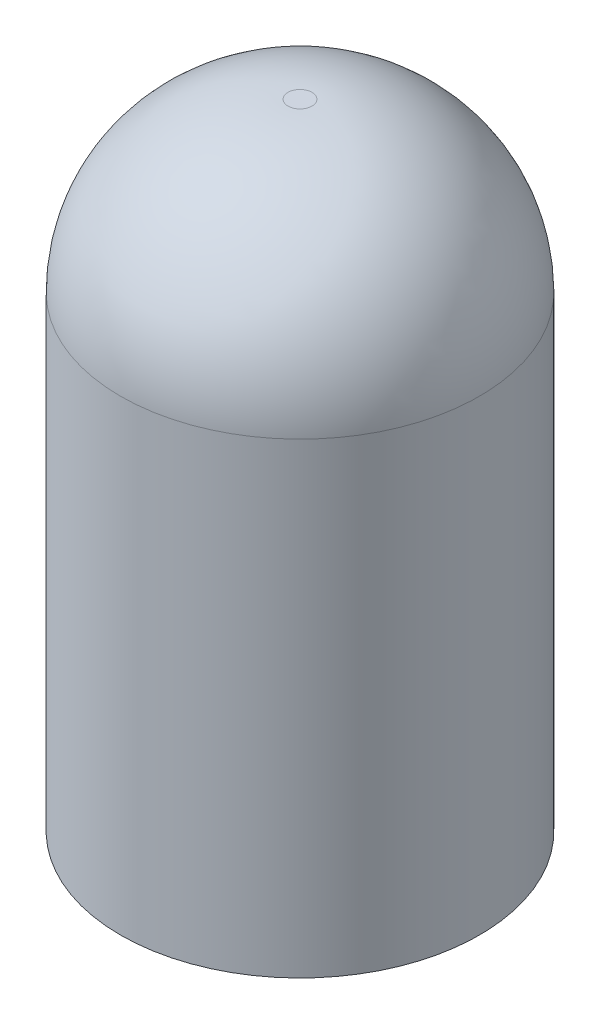
ISO-10303-21;
HEADER;
FILE_DESCRIPTION(('STEP AP214'),'2;1');
FILE_NAME('part.step','',(''),(''),'','','');
FILE_SCHEMA(('AUTOMOTIVE_DESIGN { 1 0 10303 214 1 1 1 1 }'));
ENDSEC;
DATA;
#1=APPLICATION_CONTEXT('core data for automotive mechanical design processes');
#2=APPLICATION_PROTOCOL_DEFINITION('international standard','automotive_design',2000,#1);
#3=PRODUCT_CONTEXT('',#1,'mechanical');
#4=PRODUCT('Part','Part','',(#3));
#5=PRODUCT_RELATED_PRODUCT_CATEGORY('part','',(#4));
#6=PRODUCT_DEFINITION_FORMATION('','',#4);
#7=PRODUCT_DEFINITION_CONTEXT('part definition',#1,'design');
#8=PRODUCT_DEFINITION('design','',#6,#7);
#9=PRODUCT_DEFINITION_SHAPE('','',#8);
#10=(LENGTH_UNIT() NAMED_UNIT(*) SI_UNIT(.MILLI.,.METRE.));
#11=(NAMED_UNIT(*) PLANE_ANGLE_UNIT() SI_UNIT($,.RADIAN.));
#12=(NAMED_UNIT(*) SI_UNIT($,.STERADIAN.) SOLID_ANGLE_UNIT());
#13=UNCERTAINTY_MEASURE_WITH_UNIT(LENGTH_MEASURE(1.E-05),#10,'distance_accuracy_value','');
#14=(GEOMETRIC_REPRESENTATION_CONTEXT(3) GLOBAL_UNCERTAINTY_ASSIGNED_CONTEXT((#13)) GLOBAL_UNIT_ASSIGNED_CONTEXT((#10,
#11,#12)) REPRESENTATION_CONTEXT('',''));
#15=CARTESIAN_POINT('',(0.,0.,0.));
#16=DIRECTION('',(0.,0.,1.));
#17=DIRECTION('',(1.,0.,0.));
#18=AXIS2_PLACEMENT_3D('',#15,#16,#17);
#19=CARTESIAN_POINT('',(0.,5.3,0.));
#20=DIRECTION('',(0.,-1.,0.));
#21=DIRECTION('',(0.,0.,-1.));
#22=AXIS2_PLACEMENT_3D('',#19,#20,#21);
#23=CYLINDRICAL_SURFACE('',#22,1.5);
#24=CARTESIAN_POINT('',(0.,3.9,0.));
#25=DIRECTION('',(0.,1.,0.));
#26=DIRECTION('',(0.,0.,1.));
#27=AXIS2_PLACEMENT_3D('',#24,#25,#26);
#28=CIRCLE('',#27,1.5);
#29=CARTESIAN_POINT('',(0.,3.9,1.5));
#30=VERTEX_POINT('',#29);
#31=EDGE_CURVE('E46',#30,#30,#28,.F.);
#32=ORIENTED_EDGE('',*,*,#31,.T.);
#33=EDGE_LOOP('',(#32));
#34=FACE_BOUND('',#33,.T.);
#35=CARTESIAN_POINT('',(0.,0.,0.));
#36=DIRECTION('',(0.,1.,0.));
#37=DIRECTION('',(0.,0.,1.));
#38=AXIS2_PLACEMENT_3D('',#35,#36,#37);
#39=CIRCLE('',#38,1.5);
#40=CARTESIAN_POINT('',(0.,0.,1.5));
#41=VERTEX_POINT('',#40);
#42=EDGE_CURVE('E55',#41,#41,#39,.T.);
#43=ORIENTED_EDGE('',*,*,#42,.T.);
#44=EDGE_LOOP('',(#43));
#45=FACE_BOUND('',#44,.T.);
#46=ADVANCED_FACE('F35',(#34,#45),#23,.T.);
#47=CARTESIAN_POINT('',(0.,5.3,0.));
#48=DIRECTION('',(0.,1.,0.));
#49=DIRECTION('',(0.,0.,1.));
#50=AXIS2_PLACEMENT_3D('',#47,#48,#49);
#51=PLANE('',#50);
#52=CARTESIAN_POINT('',(0.,5.3,0.));
#53=DIRECTION('',(0.,1.,0.));
#54=DIRECTION('',(0.,0.,1.));
#55=AXIS2_PLACEMENT_3D('',#52,#53,#54);
#56=CIRCLE('',#55,0.1);
#57=CARTESIAN_POINT('',(0.,5.3,0.1));
#58=VERTEX_POINT('',#57);
#59=EDGE_CURVE('E50',#58,#58,#56,.T.);
#60=ORIENTED_EDGE('',*,*,#59,.T.);
#61=EDGE_LOOP('',(#60));
#62=FACE_BOUND('',#61,.T.);
#63=ADVANCED_FACE('F80',(#62),#51,.T.);
#64=CARTESIAN_POINT('',(0.,0.,0.));
#65=DIRECTION('',(0.,1.,0.));
#66=DIRECTION('',(0.,0.,1.));
#67=AXIS2_PLACEMENT_3D('',#64,#65,#66);
#68=PLANE('',#67);
#69=CARTESIAN_POINT('',(1.175,0.,0.));
#70=DIRECTION('',(0.,1.,0.));
#71=DIRECTION('',(0.,0.,1.));
#72=AXIS2_PLACEMENT_3D('',#69,#70,#71);
#73=CIRCLE('',#72,0.2);
#74=CARTESIAN_POINT('',(1.175,0.,0.2));
#75=VERTEX_POINT('',#74);
#76=EDGE_CURVE('E10',#75,#75,#73,.F.);
#77=ORIENTED_EDGE('',*,*,#76,.F.);
#78=EDGE_LOOP('',(#77));
#79=FACE_BOUND('',#78,.T.);
#80=CARTESIAN_POINT('',(-1.175,0.,0.));
#81=DIRECTION('',(0.,1.,0.));
#82=DIRECTION('',(0.,0.,1.));
#83=AXIS2_PLACEMENT_3D('',#80,#81,#82);
#84=CIRCLE('',#83,0.2);
#85=CARTESIAN_POINT('',(-1.175,0.,0.2));
#86=VERTEX_POINT('',#85);
#87=EDGE_CURVE('E42',#86,#86,#84,.F.);
#88=ORIENTED_EDGE('',*,*,#87,.F.);
#89=EDGE_LOOP('',(#88));
#90=FACE_BOUND('',#89,.T.);
#91=ORIENTED_EDGE('',*,*,#42,.F.);
#92=EDGE_LOOP('',(#91));
#93=FACE_BOUND('',#92,.T.);
#94=ADVANCED_FACE('F85',(#79,#90,#93),#68,.F.);
#95=CARTESIAN_POINT('',(0.,3.9,0.));
#96=DIRECTION('',(0.,1.,0.));
#97=DIRECTION('',(0.,0.,1.));
#98=AXIS2_PLACEMENT_3D('',#95,#96,#97);
#99=DEGENERATE_TOROIDAL_SURFACE('',#98,0.1,1.4,.T.);
#100=ORIENTED_EDGE('',*,*,#31,.F.);
#101=EDGE_LOOP('',(#100));
#102=FACE_BOUND('',#101,.T.);
#103=ORIENTED_EDGE('',*,*,#59,.F.);
#104=EDGE_LOOP('',(#103));
#105=FACE_BOUND('',#104,.T.);
#106=ADVANCED_FACE('F37',(#102,#105),#99,.T.);
#107=CARTESIAN_POINT('',(-1.175,-0.05,0.));
#108=DIRECTION('',(0.,1.,0.));
#109=DIRECTION('',(0.,0.,1.));
#110=AXIS2_PLACEMENT_3D('',#107,#108,#109);
#111=CYLINDRICAL_SURFACE('',#110,0.2);
#112=CARTESIAN_POINT('',(-1.175,-0.05,0.));
#113=DIRECTION('',(0.,-1.,0.));
#114=DIRECTION('',(0.,0.,-1.));
#115=AXIS2_PLACEMENT_3D('',#112,#113,#114);
#116=CIRCLE('',#115,0.2);
#117=CARTESIAN_POINT('',(-1.175,-0.05,-0.2));
#118=VERTEX_POINT('',#117);
#119=EDGE_CURVE('E58',#118,#118,#116,.T.);
#120=ORIENTED_EDGE('',*,*,#119,.F.);
#121=EDGE_LOOP('',(#120));
#122=FACE_BOUND('',#121,.T.);
#123=ORIENTED_EDGE('',*,*,#87,.T.);
#124=EDGE_LOOP('',(#123));
#125=FACE_BOUND('',#124,.T.);
#126=ADVANCED_FACE('F76',(#122,#125),#111,.T.);
#127=CARTESIAN_POINT('',(0.,-0.05,0.));
#128=DIRECTION('',(0.,-1.,0.));
#129=DIRECTION('',(0.,0.,-1.));
#130=AXIS2_PLACEMENT_3D('',#127,#128,#129);
#131=PLANE('',#130);
#132=ORIENTED_EDGE('',*,*,#119,.T.);
#133=EDGE_LOOP('',(#132));
#134=FACE_BOUND('',#133,.T.);
#135=ADVANCED_FACE('F69',(#134),#131,.T.);
#136=CARTESIAN_POINT('',(1.175,-0.05,0.));
#137=DIRECTION('',(0.,1.,0.));
#138=DIRECTION('',(0.,0.,1.));
#139=AXIS2_PLACEMENT_3D('',#136,#137,#138);
#140=CYLINDRICAL_SURFACE('',#139,0.2);
#141=CARTESIAN_POINT('',(1.175,-0.05,0.));
#142=DIRECTION('',(0.,-1.,0.));
#143=DIRECTION('',(0.,0.,-1.));
#144=AXIS2_PLACEMENT_3D('',#141,#142,#143);
#145=CIRCLE('',#144,0.2);
#146=CARTESIAN_POINT('',(1.175,-0.05,-0.2));
#147=VERTEX_POINT('',#146);
#148=EDGE_CURVE('E61',#147,#147,#145,.T.);
#149=ORIENTED_EDGE('',*,*,#148,.F.);
#150=EDGE_LOOP('',(#149));
#151=FACE_BOUND('',#150,.T.);
#152=ORIENTED_EDGE('',*,*,#76,.T.);
#153=EDGE_LOOP('',(#152));
#154=FACE_BOUND('',#153,.T.);
#155=ADVANCED_FACE('F67',(#151,#154),#140,.T.);
#156=CARTESIAN_POINT('',(0.,-0.05,0.));
#157=DIRECTION('',(0.,-1.,0.));
#158=DIRECTION('',(0.,0.,-1.));
#159=AXIS2_PLACEMENT_3D('',#156,#157,#158);
#160=PLANE('',#159);
#161=ORIENTED_EDGE('',*,*,#148,.T.);
#162=EDGE_LOOP('',(#161));
#163=FACE_BOUND('',#162,.T.);
#164=ADVANCED_FACE('F65',(#163),#160,.T.);
#165=CLOSED_SHELL('',(#46,#63,#94,#106,#126,#135,#155,#164));
#166=MANIFOLD_SOLID_BREP('B2',#165);
#167=ADVANCED_BREP_SHAPE_REPRESENTATION('',(#18,#166),#14);
#168=SHAPE_DEFINITION_REPRESENTATION(#9,#167);
ENDSEC;
END-ISO-10303-21;
